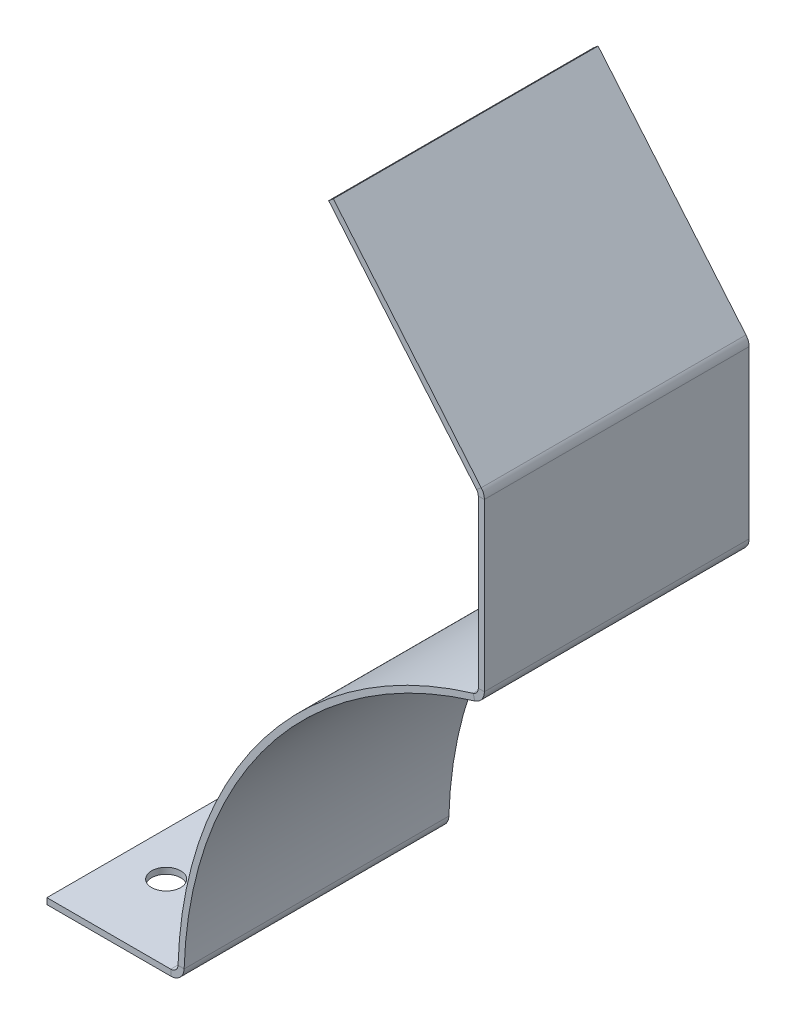
ISO-10303-21;
HEADER;
FILE_DESCRIPTION(('STEP AP214'),'2;1');
FILE_NAME('part.step','',(''),(''),'','','');
FILE_SCHEMA(('AUTOMOTIVE_DESIGN { 1 0 10303 214 1 1 1 1 }'));
ENDSEC;
DATA;
#1=APPLICATION_CONTEXT('core data for automotive mechanical design processes');
#2=APPLICATION_PROTOCOL_DEFINITION('international standard','automotive_design',2000,#1);
#3=PRODUCT_CONTEXT('',#1,'mechanical');
#4=PRODUCT('Part','Part','',(#3));
#5=PRODUCT_RELATED_PRODUCT_CATEGORY('part','',(#4));
#6=PRODUCT_DEFINITION_FORMATION('','',#4);
#7=PRODUCT_DEFINITION_CONTEXT('part definition',#1,'design');
#8=PRODUCT_DEFINITION('design','',#6,#7);
#9=PRODUCT_DEFINITION_SHAPE('','',#8);
#10=(LENGTH_UNIT() NAMED_UNIT(*) SI_UNIT(.MILLI.,.METRE.));
#11=(NAMED_UNIT(*) PLANE_ANGLE_UNIT() SI_UNIT($,.RADIAN.));
#12=(NAMED_UNIT(*) SI_UNIT($,.STERADIAN.) SOLID_ANGLE_UNIT());
#13=UNCERTAINTY_MEASURE_WITH_UNIT(LENGTH_MEASURE(1.E-05),#10,'distance_accuracy_value','');
#14=(GEOMETRIC_REPRESENTATION_CONTEXT(3) GLOBAL_UNCERTAINTY_ASSIGNED_CONTEXT((#13)) GLOBAL_UNIT_ASSIGNED_CONTEXT((#10,
#11,#12)) REPRESENTATION_CONTEXT('',''));
#15=CARTESIAN_POINT('',(0.,0.,0.));
#16=DIRECTION('',(0.,0.,1.));
#17=DIRECTION('',(1.,0.,0.));
#18=AXIS2_PLACEMENT_3D('',#15,#16,#17);
#19=CARTESIAN_POINT('',(-46.6343359967597,173.610704407755,0.));
#20=DIRECTION('',(0.,0.,-1.));
#21=DIRECTION('',(-1.,0.,0.));
#22=AXIS2_PLACEMENT_3D('',#19,#20,#21);
#23=PLANE('',#22);
#24=DIRECTION('',(-2.70456049811991E-05,0.999999999634268,0.));
#25=VECTOR('',#24,1.);
#26=CARTESIAN_POINT('',(-49.286498840737,0.67476912651559,0.));
#27=LINE('',#26,#25);
#28=CARTESIAN_POINT('',(-49.2932056168379,248.655027030668,0.));
#29=VERTEX_POINT('',#28);
#30=CARTESIAN_POINT('',(-49.2912400011612,175.977204615523,0.));
#31=VERTEX_POINT('',#30);
#32=EDGE_CURVE('E288',#29,#31,#27,.F.);
#33=ORIENTED_EDGE('',*,*,#32,.F.);
#34=DIRECTION('',(0.999999999634268,2.7045604985661E-05,0.));
#35=VECTOR('',#34,1.);
#36=CARTESIAN_POINT('',(-49.2932056168379,248.655027030668,0.));
#37=LINE('',#36,#35);
#38=CARTESIAN_POINT('',(-46.6363656178096,248.655098886514,0.));
#39=VERTEX_POINT('',#38);
#40=EDGE_CURVE('E270',#29,#39,#37,.T.);
#41=ORIENTED_EDGE('',*,*,#40,.T.);
#42=DIRECTION('',(2.70456049811991E-05,-0.999999999634268,0.));
#43=VECTOR('',#42,1.);
#44=CARTESIAN_POINT('',(-46.6343359967597,173.610704407755,0.));
#45=LINE('',#44,#43);
#46=CARTESIAN_POINT('',(-46.6344000021329,175.977276471369,0.));
#47=VERTEX_POINT('',#46);
#48=EDGE_CURVE('E156',#39,#47,#45,.T.);
#49=ORIENTED_EDGE('',*,*,#48,.T.);
#50=DIRECTION('',(0.999999999634268,2.70456049811991E-05,0.));
#51=VECTOR('',#50,1.);
#52=CARTESIAN_POINT('',(-49.2912400011612,175.977204615524,0.));
#53=LINE('',#52,#51);
#54=EDGE_CURVE('E297',#31,#47,#53,.T.);
#55=ORIENTED_EDGE('',*,*,#54,.F.);
#56=EDGE_LOOP('',(#33,#41,#49,#55));
#57=FACE_BOUND('',#56,.T.);
#58=ADVANCED_FACE('F80',(#57),#23,.T.);
#59=CARTESIAN_POINT('',(-46.6296588417087,0.674840982360728,0.));
#60=DIRECTION('',(0.999999999634268,2.70456049811991E-05,0.));
#61=DIRECTION('',(-2.70456049811991E-05,0.999999999634268,0.));
#62=AXIS2_PLACEMENT_3D('',#59,#60,#61);
#63=PLANE('',#62);
#64=ORIENTED_EDGE('',*,*,#48,.F.);
#65=DIRECTION('',(0.,0.,-1.));
#66=VECTOR('',#65,1.);
#67=CARTESIAN_POINT('',(-46.6363656178096,248.655098886514,0.));
#68=LINE('',#67,#66);
#69=CARTESIAN_POINT('',(-46.6363656178095,248.655098886514,115.57));
#70=VERTEX_POINT('',#69);
#71=EDGE_CURVE('E265',#39,#70,#68,.F.);
#72=ORIENTED_EDGE('',*,*,#71,.T.);
#73=DIRECTION('',(-2.70456049811991E-05,0.999999999634268,0.));
#74=VECTOR('',#73,1.);
#75=CARTESIAN_POINT('',(-46.6363968718592,249.810704379886,115.57));
#76=LINE('',#75,#74);
#77=CARTESIAN_POINT('',(-46.6344000021329,175.977276471369,115.57));
#78=VERTEX_POINT('',#77);
#79=EDGE_CURVE('E160',#78,#70,#76,.T.);
#80=ORIENTED_EDGE('',*,*,#79,.F.);
#81=DIRECTION('',(0.,0.,-1.));
#82=VECTOR('',#81,1.);
#83=CARTESIAN_POINT('',(-46.6344000021329,175.977276471369,0.));
#84=LINE('',#83,#82);
#85=EDGE_CURVE('E294',#78,#47,#84,.T.);
#86=ORIENTED_EDGE('',*,*,#85,.T.);
#87=EDGE_LOOP('',(#64,#72,#80,#86));
#88=FACE_BOUND('',#87,.T.);
#89=ADVANCED_FACE('F319',(#88),#63,.T.);
#90=CARTESIAN_POINT('',(-49.286498840737,0.67476912651559,0.));
#91=DIRECTION('',(0.999999999634268,2.70456049811991E-05,0.));
#92=DIRECTION('',(-2.70456049811991E-05,0.999999999634268,0.));
#93=AXIS2_PLACEMENT_3D('',#90,#91,#92);
#94=PLANE('',#93);
#95=DIRECTION('',(0.,0.,-1.));
#96=VECTOR('',#95,1.);
#97=CARTESIAN_POINT('',(-49.2932056168379,248.655027030668,0.));
#98=LINE('',#97,#96);
#99=CARTESIAN_POINT('',(-49.2932056168379,248.655027030668,115.57));
#100=VERTEX_POINT('',#99);
#101=EDGE_CURVE('E276',#29,#100,#98,.F.);
#102=ORIENTED_EDGE('',*,*,#101,.F.);
#103=ORIENTED_EDGE('',*,*,#32,.T.);
#104=DIRECTION('',(0.,0.,1.));
#105=VECTOR('',#104,1.);
#106=CARTESIAN_POINT('',(-49.2912400011612,175.977204615524,115.57));
#107=LINE('',#106,#105);
#108=CARTESIAN_POINT('',(-49.2912400011612,175.977204615524,115.57));
#109=VERTEX_POINT('',#108);
#110=EDGE_CURVE('E154',#109,#31,#107,.F.);
#111=ORIENTED_EDGE('',*,*,#110,.F.);
#112=DIRECTION('',(2.70456049811991E-05,-0.999999999634268,0.));
#113=VECTOR('',#112,1.);
#114=CARTESIAN_POINT('',(-49.286498840737,0.674769126515611,115.57));
#115=LINE('',#114,#113);
#116=EDGE_CURVE('E291',#109,#100,#115,.F.);
#117=ORIENTED_EDGE('',*,*,#116,.T.);
#118=EDGE_LOOP('',(#102,#103,#111,#117));
#119=FACE_BOUND('',#118,.T.);
#120=ADVANCED_FACE('F340',(#119),#94,.F.);
#121=CARTESIAN_POINT('',(0.,0.,115.57));
#122=DIRECTION('',(0.,0.,-1.));
#123=DIRECTION('',(-1.,0.,0.));
#124=AXIS2_PLACEMENT_3D('',#121,#122,#123);
#125=CYLINDRICAL_SURFACE('',#124,180.45684);
#126=CARTESIAN_POINT('',(0.,0.,0.));
#127=DIRECTION('',(0.,0.,1.));
#128=DIRECTION('',(1.,0.,0.));
#129=AXIS2_PLACEMENT_3D('',#126,#127,#128);
#130=CIRCLE('',#129,180.45684);
#131=CARTESIAN_POINT('',(-51.5590971428571,172.934469104916,0.));
#132=VERTEX_POINT('',#131);
#133=CARTESIAN_POINT('',(-180.366311024075,5.71532591828572,0.));
#134=VERTEX_POINT('',#133);
#135=EDGE_CURVE('E119',#132,#134,#130,.T.);
#136=ORIENTED_EDGE('',*,*,#135,.T.);
#137=DIRECTION('',(0.,0.,-1.));
#138=VECTOR('',#137,1.);
#139=CARTESIAN_POINT('',(-180.366311024075,5.71532591828572,115.57));
#140=LINE('',#139,#138);
#141=CARTESIAN_POINT('',(-180.366311024075,5.71532591828572,115.57));
#142=VERTEX_POINT('',#141);
#143=EDGE_CURVE('E13',#142,#134,#140,.T.);
#144=ORIENTED_EDGE('',*,*,#143,.F.);
#145=CARTESIAN_POINT('',(0.,0.,115.57));
#146=DIRECTION('',(0.,0.,1.));
#147=DIRECTION('',(1.,0.,0.));
#148=AXIS2_PLACEMENT_3D('',#145,#146,#147);
#149=CIRCLE('',#148,180.45684);
#150=CARTESIAN_POINT('',(-51.5590971428571,172.934469104916,115.57));
#151=VERTEX_POINT('',#150);
#152=EDGE_CURVE('E104',#151,#142,#149,.T.);
#153=ORIENTED_EDGE('',*,*,#152,.F.);
#154=DIRECTION('',(0.,0.,-1.));
#155=VECTOR('',#154,1.);
#156=CARTESIAN_POINT('',(-51.5590971428571,172.934469104916,115.57));
#157=LINE('',#156,#155);
#158=EDGE_CURVE('E116',#151,#132,#157,.T.);
#159=ORIENTED_EDGE('',*,*,#158,.T.);
#160=EDGE_LOOP('',(#136,#144,#153,#159));
#161=FACE_BOUND('',#160,.T.);
#162=ADVANCED_FACE('F82',(#161),#125,.T.);
#163=CARTESIAN_POINT('',(0.,0.,115.57));
#164=DIRECTION('',(0.,0.,-1.));
#165=DIRECTION('',(-1.,0.,0.));
#166=AXIS2_PLACEMENT_3D('',#163,#164,#165);
#167=CYLINDRICAL_SURFACE('',#166,177.8);
#168=CARTESIAN_POINT('',(0.,0.,0.));
#169=DIRECTION('',(0.,0.,1.));
#170=DIRECTION('',(1.,0.,0.));
#171=AXIS2_PLACEMENT_3D('',#168,#169,#170);
#172=CIRCLE('',#171,177.8);
#173=CARTESIAN_POINT('',(-50.7999999999999,170.388379885484,0.));
#174=VERTEX_POINT('',#173);
#175=CARTESIAN_POINT('',(-177.710803869116,5.63118000000001,0.));
#176=VERTEX_POINT('',#175);
#177=EDGE_CURVE('E149',#174,#176,#172,.T.);
#178=ORIENTED_EDGE('',*,*,#177,.F.);
#179=DIRECTION('',(0.,0.,-1.));
#180=VECTOR('',#179,1.);
#181=CARTESIAN_POINT('',(-50.8,170.388379885484,115.57));
#182=LINE('',#181,#180);
#183=CARTESIAN_POINT('',(-50.8,170.388379885484,115.57));
#184=VERTEX_POINT('',#183);
#185=EDGE_CURVE('E125',#184,#174,#182,.T.);
#186=ORIENTED_EDGE('',*,*,#185,.F.);
#187=CARTESIAN_POINT('',(0.,0.,115.57));
#188=DIRECTION('',(0.,0.,1.));
#189=DIRECTION('',(1.,0.,0.));
#190=AXIS2_PLACEMENT_3D('',#187,#188,#189);
#191=CIRCLE('',#190,177.8);
#192=CARTESIAN_POINT('',(-177.710803869116,5.63118000000001,115.57));
#193=VERTEX_POINT('',#192);
#194=EDGE_CURVE('E168',#184,#193,#191,.T.);
#195=ORIENTED_EDGE('',*,*,#194,.T.);
#196=DIRECTION('',(0.,0.,-1.));
#197=VECTOR('',#196,1.);
#198=CARTESIAN_POINT('',(-177.710803869116,5.63118000000001,115.57));
#199=LINE('',#198,#197);
#200=EDGE_CURVE('E88',#193,#176,#199,.T.);
#201=ORIENTED_EDGE('',*,*,#200,.T.);
#202=EDGE_LOOP('',(#178,#186,#195,#201));
#203=FACE_BOUND('',#202,.T.);
#204=ADVANCED_FACE('F179',(#203),#167,.F.);
#205=CARTESIAN_POINT('',(0.,0.,115.57));
#206=DIRECTION('',(0.,0.,1.));
#207=DIRECTION('',(1.,0.,0.));
#208=AXIS2_PLACEMENT_3D('',#205,#206,#207);
#209=PLANE('',#208);
#210=ORIENTED_EDGE('',*,*,#152,.T.);
#211=DIRECTION('',(-0.999498334471971,0.031671428571428,0.));
#212=VECTOR('',#211,1.);
#213=CARTESIAN_POINT('',(-177.710803869116,5.63118000000001,115.57));
#214=LINE('',#213,#212);
#215=EDGE_CURVE('E165',#193,#142,#214,.T.);
#216=ORIENTED_EDGE('',*,*,#215,.F.);
#217=ORIENTED_EDGE('',*,*,#194,.F.);
#218=DIRECTION('',(0.285714285714285,-0.95831484749991,0.));
#219=VECTOR('',#218,1.);
#220=CARTESIAN_POINT('',(-51.5590971428571,172.934469104916,115.57));
#221=LINE('',#220,#219);
#222=EDGE_CURVE('E126',#151,#184,#221,.T.);
#223=ORIENTED_EDGE('',*,*,#222,.F.);
#224=EDGE_LOOP('',(#210,#216,#217,#223));
#225=FACE_BOUND('',#224,.T.);
#226=ADVANCED_FACE('F207',(#225),#209,.T.);
#227=CARTESIAN_POINT('',(0.,0.,0.));
#228=DIRECTION('',(0.,0.,1.));
#229=DIRECTION('',(1.,0.,0.));
#230=AXIS2_PLACEMENT_3D('',#227,#228,#229);
#231=PLANE('',#230);
#232=ORIENTED_EDGE('',*,*,#135,.F.);
#233=DIRECTION('',(0.285714285714285,-0.95831484749991,0.));
#234=VECTOR('',#233,1.);
#235=CARTESIAN_POINT('',(-51.5590971428571,172.934469104916,0.));
#236=LINE('',#235,#234);
#237=EDGE_CURVE('E133',#132,#174,#236,.T.);
#238=ORIENTED_EDGE('',*,*,#237,.T.);
#239=ORIENTED_EDGE('',*,*,#177,.T.);
#240=DIRECTION('',(-0.999498334471971,0.031671428571428,0.));
#241=VECTOR('',#240,1.);
#242=CARTESIAN_POINT('',(-177.710803869116,5.63118000000001,0.));
#243=LINE('',#242,#241);
#244=EDGE_CURVE('E136',#176,#134,#243,.T.);
#245=ORIENTED_EDGE('',*,*,#244,.T.);
#246=EDGE_LOOP('',(#232,#238,#239,#245));
#247=FACE_BOUND('',#246,.T.);
#248=ADVANCED_FACE('F131',(#247),#231,.F.);
#249=CARTESIAN_POINT('',(-52.46624,175.977118745728,115.57));
#250=DIRECTION('',(0.,0.,1.));
#251=DIRECTION('',(0.,-1.,0.));
#252=AXIS2_PLACEMENT_3D('',#249,#250,#251);
#253=PLANE('',#252);
#254=DIRECTION('',(0.999999999634268,2.70456049811991E-05,0.));
#255=VECTOR('',#254,1.);
#256=CARTESIAN_POINT('',(-46.6344000021329,175.977276471369,115.57));
#257=LINE('',#256,#255);
#258=EDGE_CURVE('E283',#109,#78,#257,.T.);
#259=ORIENTED_EDGE('',*,*,#258,.F.);
#260=CARTESIAN_POINT('',(-52.46624,175.977118745728,115.57));
#261=DIRECTION('',(0.,0.,-1.));
#262=DIRECTION('',(0.,1.,0.));
#263=AXIS2_PLACEMENT_3D('',#260,#261,#262);
#264=CIRCLE('',#263,3.17499999999999);
#265=EDGE_CURVE('E155',#151,#109,#264,.F.);
#266=ORIENTED_EDGE('',*,*,#265,.F.);
#267=ORIENTED_EDGE('',*,*,#222,.T.);
#268=CARTESIAN_POINT('',(-52.46624,175.977118745728,115.57));
#269=DIRECTION('',(0.,0.,-1.));
#270=DIRECTION('',(0.,1.,0.));
#271=AXIS2_PLACEMENT_3D('',#268,#269,#270);
#272=CIRCLE('',#271,5.83183999999999);
#273=EDGE_CURVE('E137',#184,#78,#272,.F.);
#274=ORIENTED_EDGE('',*,*,#273,.T.);
#275=EDGE_LOOP('',(#259,#266,#267,#274));
#276=FACE_BOUND('',#275,.T.);
#277=ADVANCED_FACE('F307',(#276),#253,.T.);
#278=CARTESIAN_POINT('',(-52.46624,175.977118745728,0.));
#279=DIRECTION('',(0.,0.,1.));
#280=DIRECTION('',(0.,-1.,0.));
#281=AXIS2_PLACEMENT_3D('',#278,#279,#280);
#282=PLANE('',#281);
#283=CARTESIAN_POINT('',(-52.46624,175.977118745728,0.));
#284=DIRECTION('',(0.,0.,-1.));
#285=DIRECTION('',(0.,1.,0.));
#286=AXIS2_PLACEMENT_3D('',#283,#284,#285);
#287=CIRCLE('',#286,3.17499999999999);
#288=EDGE_CURVE('E145',#31,#132,#287,.T.);
#289=ORIENTED_EDGE('',*,*,#288,.F.);
#290=ORIENTED_EDGE('',*,*,#54,.T.);
#291=CARTESIAN_POINT('',(-52.46624,175.977118745728,0.));
#292=DIRECTION('',(0.,0.,-1.));
#293=DIRECTION('',(0.,1.,0.));
#294=AXIS2_PLACEMENT_3D('',#291,#292,#293);
#295=CIRCLE('',#294,5.83183999999999);
#296=EDGE_CURVE('E148',#47,#174,#295,.T.);
#297=ORIENTED_EDGE('',*,*,#296,.T.);
#298=ORIENTED_EDGE('',*,*,#237,.F.);
#299=EDGE_LOOP('',(#289,#290,#297,#298));
#300=FACE_BOUND('',#299,.T.);
#301=ADVANCED_FACE('F142',(#300),#282,.F.);
#302=CARTESIAN_POINT('',(-52.46624,175.977118745728,0.));
#303=DIRECTION('',(0.,0.,-1.));
#304=DIRECTION('',(0.999999999634268,2.70456049811991E-05,0.));
#305=AXIS2_PLACEMENT_3D('',#302,#303,#304);
#306=CYLINDRICAL_SURFACE('',#305,5.83183999999999);
#307=ORIENTED_EDGE('',*,*,#185,.T.);
#308=ORIENTED_EDGE('',*,*,#296,.F.);
#309=ORIENTED_EDGE('',*,*,#85,.F.);
#310=ORIENTED_EDGE('',*,*,#273,.F.);
#311=EDGE_LOOP('',(#307,#308,#309,#310));
#312=FACE_BOUND('',#311,.T.);
#313=ADVANCED_FACE('F444',(#312),#306,.T.);
#314=CARTESIAN_POINT('',(-52.46624,175.977118745728,0.));
#315=DIRECTION('',(0.,0.,-1.));
#316=DIRECTION('',(0.999999999634268,2.70456049811991E-05,0.));
#317=AXIS2_PLACEMENT_3D('',#314,#315,#316);
#318=CYLINDRICAL_SURFACE('',#317,3.17499999999999);
#319=ORIENTED_EDGE('',*,*,#158,.F.);
#320=ORIENTED_EDGE('',*,*,#265,.T.);
#321=ORIENTED_EDGE('',*,*,#110,.T.);
#322=ORIENTED_EDGE('',*,*,#288,.T.);
#323=EDGE_LOOP('',(#319,#320,#321,#322));
#324=FACE_BOUND('',#323,.T.);
#325=ADVANCED_FACE('F152',(#324),#318,.F.);
#326=CARTESIAN_POINT('',(-46.6363968718592,249.810704379886,115.57));
#327=DIRECTION('',(0.,0.,1.));
#328=DIRECTION('',(0.,-1.,0.));
#329=AXIS2_PLACEMENT_3D('',#326,#327,#328);
#330=PLANE('',#329);
#331=DIRECTION('',(0.999999999634268,2.7045604985661E-05,0.));
#332=VECTOR('',#331,1.);
#333=CARTESIAN_POINT('',(-49.2932056168379,248.655027030668,115.57));
#334=LINE('',#333,#332);
#335=EDGE_CURVE('E281',#100,#70,#334,.T.);
#336=ORIENTED_EDGE('',*,*,#335,.F.);
#337=ORIENTED_EDGE('',*,*,#116,.F.);
#338=ORIENTED_EDGE('',*,*,#258,.T.);
#339=ORIENTED_EDGE('',*,*,#79,.T.);
#340=EDGE_LOOP('',(#336,#337,#338,#339));
#341=FACE_BOUND('',#340,.T.);
#342=ADVANCED_FACE('F316',(#341),#330,.T.);
#343=CARTESIAN_POINT('',(-52.4682056156767,248.654941160873,115.57));
#344=DIRECTION('',(0.,0.,1.));
#345=DIRECTION('',(1.,0.,0.));
#346=AXIS2_PLACEMENT_3D('',#343,#344,#345);
#347=PLANE('',#346);
#348=DIRECTION('',(0.766027058259036,0.642808327586853,0.));
#349=VECTOR('',#348,1.);
#350=CARTESIAN_POINT('',(-50.0360697057042,250.695857600961,115.57));
#351=LINE('',#350,#349);
#352=CARTESIAN_POINT('',(-50.0360697057043,250.695857600961,115.57));
#353=VERTEX_POINT('',#352);
#354=CARTESIAN_POINT('',(-48.0008583762393,252.403696478027,115.57));
#355=VERTEX_POINT('',#354);
#356=EDGE_CURVE('E233',#353,#355,#351,.T.);
#357=ORIENTED_EDGE('',*,*,#356,.F.);
#358=CARTESIAN_POINT('',(-52.4682056156767,248.654941160873,115.57));
#359=DIRECTION('',(0.,0.,-1.));
#360=DIRECTION('',(-1.,0.,0.));
#361=AXIS2_PLACEMENT_3D('',#358,#359,#360);
#362=CIRCLE('',#361,3.17500000000001);
#363=EDGE_CURVE('E273',#100,#353,#362,.F.);
#364=ORIENTED_EDGE('',*,*,#363,.F.);
#365=ORIENTED_EDGE('',*,*,#335,.T.);
#366=CARTESIAN_POINT('',(-52.4682056156767,248.654941160873,115.57));
#367=DIRECTION('',(0.,0.,-1.));
#368=DIRECTION('',(-1.,0.,0.));
#369=AXIS2_PLACEMENT_3D('',#366,#367,#368);
#370=CIRCLE('',#369,5.83184000000001);
#371=EDGE_CURVE('E95',#70,#355,#370,.F.);
#372=ORIENTED_EDGE('',*,*,#371,.T.);
#373=EDGE_LOOP('',(#357,#364,#365,#372));
#374=FACE_BOUND('',#373,.T.);
#375=ADVANCED_FACE('F443',(#374),#347,.T.);
#376=CARTESIAN_POINT('',(-52.4682056156767,248.654941160873,0.));
#377=DIRECTION('',(0.,0.,1.));
#378=DIRECTION('',(1.,0.,0.));
#379=AXIS2_PLACEMENT_3D('',#376,#377,#378);
#380=PLANE('',#379);
#381=CARTESIAN_POINT('',(-52.4682056156767,248.654941160873,0.));
#382=DIRECTION('',(0.,0.,-1.));
#383=DIRECTION('',(-1.,0.,0.));
#384=AXIS2_PLACEMENT_3D('',#381,#382,#383);
#385=CIRCLE('',#384,3.17500000000001);
#386=CARTESIAN_POINT('',(-50.0360697057043,250.695857600961,0.));
#387=VERTEX_POINT('',#386);
#388=EDGE_CURVE('E264',#387,#29,#385,.T.);
#389=ORIENTED_EDGE('',*,*,#388,.F.);
#390=DIRECTION('',(0.766027058259036,0.642808327586853,0.));
#391=VECTOR('',#390,1.);
#392=CARTESIAN_POINT('',(-50.0360697057042,250.695857600961,0.));
#393=LINE('',#392,#391);
#394=CARTESIAN_POINT('',(-48.0008583762393,252.403696478027,0.));
#395=VERTEX_POINT('',#394);
#396=EDGE_CURVE('E232',#387,#395,#393,.T.);
#397=ORIENTED_EDGE('',*,*,#396,.T.);
#398=CARTESIAN_POINT('',(-52.4682056156767,248.654941160873,0.));
#399=DIRECTION('',(0.,0.,-1.));
#400=DIRECTION('',(-1.,0.,0.));
#401=AXIS2_PLACEMENT_3D('',#398,#399,#400);
#402=CIRCLE('',#401,5.83184000000001);
#403=EDGE_CURVE('E268',#395,#39,#402,.T.);
#404=ORIENTED_EDGE('',*,*,#403,.T.);
#405=ORIENTED_EDGE('',*,*,#40,.F.);
#406=EDGE_LOOP('',(#389,#397,#404,#405));
#407=FACE_BOUND('',#406,.T.);
#408=ADVANCED_FACE('F329',(#407),#380,.F.);
#409=CARTESIAN_POINT('',(-52.4682056156767,248.654941160873,0.));
#410=DIRECTION('',(0.,0.,-1.));
#411=DIRECTION('',(0.766027058259036,0.642808327586853,0.));
#412=AXIS2_PLACEMENT_3D('',#409,#410,#411);
#413=CYLINDRICAL_SURFACE('',#412,5.83184000000001);
#414=ORIENTED_EDGE('',*,*,#71,.F.);
#415=ORIENTED_EDGE('',*,*,#403,.F.);
#416=DIRECTION('',(0.,0.,1.));
#417=VECTOR('',#416,1.);
#418=CARTESIAN_POINT('',(-48.0008583762393,252.403696478027,0.));
#419=LINE('',#418,#417);
#420=EDGE_CURVE('E236',#395,#355,#419,.T.);
#421=ORIENTED_EDGE('',*,*,#420,.T.);
#422=ORIENTED_EDGE('',*,*,#371,.F.);
#423=EDGE_LOOP('',(#414,#415,#421,#422));
#424=FACE_BOUND('',#423,.T.);
#425=ADVANCED_FACE('F323',(#424),#413,.T.);
#426=CARTESIAN_POINT('',(-52.4682056156767,248.654941160873,0.));
#427=DIRECTION('',(0.,0.,-1.));
#428=DIRECTION('',(0.766027058259036,0.642808327586853,0.));
#429=AXIS2_PLACEMENT_3D('',#426,#427,#428);
#430=CYLINDRICAL_SURFACE('',#429,3.17500000000001);
#431=ORIENTED_EDGE('',*,*,#101,.T.);
#432=ORIENTED_EDGE('',*,*,#363,.T.);
#433=DIRECTION('',(0.,0.,-1.));
#434=VECTOR('',#433,1.);
#435=CARTESIAN_POINT('',(-50.0360697057042,250.695857600961,115.57));
#436=LINE('',#435,#434);
#437=EDGE_CURVE('E229',#353,#387,#436,.T.);
#438=ORIENTED_EDGE('',*,*,#437,.T.);
#439=ORIENTED_EDGE('',*,*,#388,.T.);
#440=EDGE_LOOP('',(#431,#432,#438,#439));
#441=FACE_BOUND('',#440,.T.);
#442=ADVANCED_FACE('F582',(#441),#430,.F.);
#443=CARTESIAN_POINT('',(-47.2580255414226,251.518471401107,115.57));
#444=DIRECTION('',(0.,0.,-1.));
#445=DIRECTION('',(-1.,0.,0.));
#446=AXIS2_PLACEMENT_3D('',#443,#444,#445);
#447=PLANE('',#446);
#448=ORIENTED_EDGE('',*,*,#356,.T.);
#449=DIRECTION('',(0.642808327586853,-0.766027058259036,0.));
#450=VECTOR('',#449,1.);
#451=CARTESIAN_POINT('',(-47.2580255414226,251.518471401107,115.57));
#452=LINE('',#451,#450);
#453=CARTESIAN_POINT('',(-112.567351624247,329.346820520225,115.57));
#454=VERTEX_POINT('',#453);
#455=EDGE_CURVE('E241',#454,#355,#452,.T.);
#456=ORIENTED_EDGE('',*,*,#455,.F.);
#457=DIRECTION('',(-0.766027058259036,-0.642808327586853,0.));
#458=VECTOR('',#457,1.);
#459=CARTESIAN_POINT('',(-112.567351624247,329.346820520225,115.57));
#460=LINE('',#459,#458);
#461=CARTESIAN_POINT('',(-114.602562953712,327.638981643159,115.57));
#462=VERTEX_POINT('',#461);
#463=EDGE_CURVE('E251',#454,#462,#460,.T.);
#464=ORIENTED_EDGE('',*,*,#463,.T.);
#465=DIRECTION('',(0.642808327586853,-0.766027058259036,0.));
#466=VECTOR('',#465,1.);
#467=CARTESIAN_POINT('',(-49.2932368708876,249.810632524041,115.57));
#468=LINE('',#467,#466);
#469=EDGE_CURVE('E240',#462,#353,#468,.T.);
#470=ORIENTED_EDGE('',*,*,#469,.T.);
#471=EDGE_LOOP('',(#448,#456,#464,#470));
#472=FACE_BOUND('',#471,.T.);
#473=ADVANCED_FACE('F571',(#472),#447,.F.);
#474=CARTESIAN_POINT('',(-112.567351624247,329.346820520225,0.));
#475=DIRECTION('',(0.,0.,1.));
#476=DIRECTION('',(0.,-1.,0.));
#477=AXIS2_PLACEMENT_3D('',#474,#475,#476);
#478=PLANE('',#477);
#479=ORIENTED_EDGE('',*,*,#396,.F.);
#480=DIRECTION('',(-0.642808327586853,0.766027058259036,0.));
#481=VECTOR('',#480,1.);
#482=CARTESIAN_POINT('',(-114.602562953712,327.638981643159,0.));
#483=LINE('',#482,#481);
#484=CARTESIAN_POINT('',(-114.602562953712,327.638981643159,0.));
#485=VERTEX_POINT('',#484);
#486=EDGE_CURVE('E254',#387,#485,#483,.T.);
#487=ORIENTED_EDGE('',*,*,#486,.T.);
#488=DIRECTION('',(-0.766027058259036,-0.642808327586853,0.));
#489=VECTOR('',#488,1.);
#490=CARTESIAN_POINT('',(-112.567351624247,329.346820520225,0.));
#491=LINE('',#490,#489);
#492=CARTESIAN_POINT('',(-112.567351624247,329.346820520225,0.));
#493=VERTEX_POINT('',#492);
#494=EDGE_CURVE('E261',#493,#485,#491,.T.);
#495=ORIENTED_EDGE('',*,*,#494,.F.);
#496=DIRECTION('',(-0.642808327586853,0.766027058259036,0.));
#497=VECTOR('',#496,1.);
#498=CARTESIAN_POINT('',(-112.567351624247,329.346820520225,0.));
#499=LINE('',#498,#497);
#500=EDGE_CURVE('E244',#395,#493,#499,.T.);
#501=ORIENTED_EDGE('',*,*,#500,.F.);
#502=EDGE_LOOP('',(#479,#487,#495,#501));
#503=FACE_BOUND('',#502,.T.);
#504=ADVANCED_FACE('F560',(#503),#478,.F.);
#505=CARTESIAN_POINT('',(96.1189623179318,80.6578158706245,0.));
#506=DIRECTION('',(-0.766027058259036,-0.642808327586853,0.));
#507=DIRECTION('',(0.642808327586853,-0.766027058259036,0.));
#508=AXIS2_PLACEMENT_3D('',#505,#506,#507);
#509=PLANE('',#508);
#510=ORIENTED_EDGE('',*,*,#420,.F.);
#511=ORIENTED_EDGE('',*,*,#500,.T.);
#512=DIRECTION('',(0.,0.,1.));
#513=VECTOR('',#512,1.);
#514=CARTESIAN_POINT('',(-112.567351624247,329.346820520225,115.57));
#515=LINE('',#514,#513);
#516=EDGE_CURVE('E248',#493,#454,#515,.T.);
#517=ORIENTED_EDGE('',*,*,#516,.T.);
#518=ORIENTED_EDGE('',*,*,#455,.T.);
#519=EDGE_LOOP('',(#510,#511,#517,#518));
#520=FACE_BOUND('',#519,.T.);
#521=ADVANCED_FACE('F549',(#520),#509,.F.);
#522=CARTESIAN_POINT('',(94.0837509884668,78.9499769935587,0.));
#523=DIRECTION('',(-0.766027058259036,-0.642808327586853,0.));
#524=DIRECTION('',(0.642808327586853,-0.766027058259036,0.));
#525=AXIS2_PLACEMENT_3D('',#522,#523,#524);
#526=PLANE('',#525);
#527=ORIENTED_EDGE('',*,*,#486,.F.);
#528=ORIENTED_EDGE('',*,*,#437,.F.);
#529=ORIENTED_EDGE('',*,*,#469,.F.);
#530=DIRECTION('',(0.,0.,1.));
#531=VECTOR('',#530,1.);
#532=CARTESIAN_POINT('',(-114.602562953712,327.638981643159,115.57));
#533=LINE('',#532,#531);
#534=EDGE_CURVE('E245',#485,#462,#533,.T.);
#535=ORIENTED_EDGE('',*,*,#534,.F.);
#536=EDGE_LOOP('',(#527,#528,#529,#535));
#537=FACE_BOUND('',#536,.T.);
#538=ADVANCED_FACE('F536',(#537),#526,.T.);
#539=CARTESIAN_POINT('',(-112.567351624247,329.346820520225,115.57));
#540=DIRECTION('',(0.642808327586853,-0.766027058259036,0.));
#541=DIRECTION('',(0.766027058259036,0.642808327586853,0.));
#542=AXIS2_PLACEMENT_3D('',#539,#540,#541);
#543=PLANE('',#542);
#544=ORIENTED_EDGE('',*,*,#534,.T.);
#545=ORIENTED_EDGE('',*,*,#463,.F.);
#546=ORIENTED_EDGE('',*,*,#516,.F.);
#547=ORIENTED_EDGE('',*,*,#494,.T.);
#548=EDGE_LOOP('',(#544,#545,#546,#547));
#549=FACE_BOUND('',#548,.T.);
#550=ADVANCED_FACE('F531',(#549),#543,.F.);
#551=CARTESIAN_POINT('',(-183.539718236024,5.815882704,0.));
#552=DIRECTION('',(0.,0.,-1.));
#553=DIRECTION('',(-1.,0.,0.));
#554=AXIS2_PLACEMENT_3D('',#551,#552,#553);
#555=PLANE('',#554);
#556=DIRECTION('',(-8.62663278542215E-05,-0.99999999627906,0.));
#557=VECTOR('',#556,1.);
#558=CARTESIAN_POINT('',(-183.540221327445,-0.0159572743000692,0.));
#559=LINE('',#558,#557);
#560=CARTESIAN_POINT('',(-183.539992131614,2.64088271581396,0.));
#561=VERTEX_POINT('',#560);
#562=CARTESIAN_POINT('',(-183.540221327445,-0.0159572743000944,0.));
#563=VERTEX_POINT('',#562);
#564=EDGE_CURVE('E223',#561,#563,#559,.T.);
#565=ORIENTED_EDGE('',*,*,#564,.F.);
#566=CARTESIAN_POINT('',(-183.539718236024,5.815882704,0.));
#567=DIRECTION('',(0.,0.,1.));
#568=DIRECTION('',(1.,0.,0.));
#569=AXIS2_PLACEMENT_3D('',#566,#567,#568);
#570=CIRCLE('',#569,3.17500000000002);
#571=EDGE_CURVE('E204',#134,#561,#570,.F.);
#572=ORIENTED_EDGE('',*,*,#571,.F.);
#573=ORIENTED_EDGE('',*,*,#244,.F.);
#574=CARTESIAN_POINT('',(-183.539718236024,5.815882704,0.));
#575=DIRECTION('',(0.,0.,1.));
#576=DIRECTION('',(1.,0.,0.));
#577=AXIS2_PLACEMENT_3D('',#574,#575,#576);
#578=CIRCLE('',#577,5.83184000000002);
#579=EDGE_CURVE('E191',#176,#563,#578,.F.);
#580=ORIENTED_EDGE('',*,*,#579,.T.);
#581=EDGE_LOOP('',(#565,#572,#573,#580));
#582=FACE_BOUND('',#581,.T.);
#583=ADVANCED_FACE('F221',(#582),#555,.T.);
#584=CARTESIAN_POINT('',(-183.539718236024,5.815882704,115.57));
#585=DIRECTION('',(0.,0.,-1.));
#586=DIRECTION('',(-1.,0.,0.));
#587=AXIS2_PLACEMENT_3D('',#584,#585,#586);
#588=PLANE('',#587);
#589=CARTESIAN_POINT('',(-183.539718236024,5.815882704,115.57));
#590=DIRECTION('',(0.,0.,1.));
#591=DIRECTION('',(1.,0.,0.));
#592=AXIS2_PLACEMENT_3D('',#589,#590,#591);
#593=CIRCLE('',#592,3.17500000000002);
#594=CARTESIAN_POINT('',(-183.539992131614,2.64088271581396,115.57));
#595=VERTEX_POINT('',#594);
#596=EDGE_CURVE('E217',#595,#142,#593,.T.);
#597=ORIENTED_EDGE('',*,*,#596,.F.);
#598=DIRECTION('',(-8.62663278542215E-05,-0.99999999627906,0.));
#599=VECTOR('',#598,1.);
#600=CARTESIAN_POINT('',(-183.539992131614,2.64088271581396,115.57));
#601=LINE('',#600,#599);
#602=CARTESIAN_POINT('',(-183.540221327445,-0.0159572743000683,115.57));
#603=VERTEX_POINT('',#602);
#604=EDGE_CURVE('E202',#595,#603,#601,.T.);
#605=ORIENTED_EDGE('',*,*,#604,.T.);
#606=CARTESIAN_POINT('',(-183.539718236024,5.815882704,115.57));
#607=DIRECTION('',(0.,0.,1.));
#608=DIRECTION('',(1.,0.,0.));
#609=AXIS2_PLACEMENT_3D('',#606,#607,#608);
#610=CIRCLE('',#609,5.83184000000002);
#611=EDGE_CURVE('E188',#603,#193,#610,.T.);
#612=ORIENTED_EDGE('',*,*,#611,.T.);
#613=ORIENTED_EDGE('',*,*,#215,.T.);
#614=EDGE_LOOP('',(#597,#605,#612,#613));
#615=FACE_BOUND('',#614,.T.);
#616=ADVANCED_FACE('F198',(#615),#588,.F.);
#617=CARTESIAN_POINT('',(-183.539718236024,5.815882704,115.57));
#618=DIRECTION('',(0.,0.,1.));
#619=DIRECTION('',(-8.62663278542216E-05,-0.99999999627906,0.));
#620=AXIS2_PLACEMENT_3D('',#617,#618,#619);
#621=CYLINDRICAL_SURFACE('',#620,5.83184000000002);
#622=ORIENTED_EDGE('',*,*,#200,.F.);
#623=ORIENTED_EDGE('',*,*,#611,.F.);
#624=DIRECTION('',(0.,0.,1.));
#625=VECTOR('',#624,1.);
#626=CARTESIAN_POINT('',(-183.540221327445,-0.0159572743000678,0.));
#627=LINE('',#626,#625);
#628=EDGE_CURVE('E399',#563,#603,#627,.T.);
#629=ORIENTED_EDGE('',*,*,#628,.F.);
#630=ORIENTED_EDGE('',*,*,#579,.F.);
#631=EDGE_LOOP('',(#622,#623,#629,#630));
#632=FACE_BOUND('',#631,.T.);
#633=ADVANCED_FACE('F185',(#632),#621,.T.);
#634=CARTESIAN_POINT('',(-183.539718236024,5.815882704,115.57));
#635=DIRECTION('',(0.,0.,1.));
#636=DIRECTION('',(-8.62663278542216E-05,-0.99999999627906,0.));
#637=AXIS2_PLACEMENT_3D('',#634,#635,#636);
#638=CYLINDRICAL_SURFACE('',#637,3.17500000000002);
#639=ORIENTED_EDGE('',*,*,#143,.T.);
#640=ORIENTED_EDGE('',*,*,#571,.T.);
#641=DIRECTION('',(0.,0.,-1.));
#642=VECTOR('',#641,1.);
#643=CARTESIAN_POINT('',(-183.539992131614,2.64088271581396,0.));
#644=LINE('',#643,#642);
#645=EDGE_CURVE('E411',#561,#595,#644,.F.);
#646=ORIENTED_EDGE('',*,*,#645,.T.);
#647=ORIENTED_EDGE('',*,*,#596,.T.);
#648=EDGE_LOOP('',(#639,#640,#646,#647));
#649=FACE_BOUND('',#648,.T.);
#650=ADVANCED_FACE('F213',(#649),#638,.F.);
#651=CARTESIAN_POINT('',(-180.463969509973,-0.0162226512489048,115.57));
#652=DIRECTION('',(0.,0.,1.));
#653=DIRECTION('',(1.,0.,0.));
#654=AXIS2_PLACEMENT_3D('',#651,#652,#653);
#655=PLANE('',#654);
#656=DIRECTION('',(0.99999999627906,-8.62663278542216E-05,0.));
#657=VECTOR('',#656,1.);
#658=CARTESIAN_POINT('',(-180.463969509973,-0.0162226512489048,115.57));
#659=LINE('',#658,#657);
#660=CARTESIAN_POINT('',(-237.613969297321,-0.0112925306120361,115.57));
#661=VERTEX_POINT('',#660);
#662=EDGE_CURVE('E381',#661,#603,#659,.T.);
#663=ORIENTED_EDGE('',*,*,#662,.T.);
#664=ORIENTED_EDGE('',*,*,#604,.F.);
#665=DIRECTION('',(-0.99999999627906,8.62663278542216E-05,0.));
#666=VECTOR('',#665,1.);
#667=CARTESIAN_POINT('',(-0.0969375921540186,2.62505775706963,115.57));
#668=LINE('',#667,#666);
#669=CARTESIAN_POINT('',(-237.613740101491,2.64554745950202,115.57));
#670=VERTEX_POINT('',#669);
#671=EDGE_CURVE('E383',#670,#595,#668,.F.);
#672=ORIENTED_EDGE('',*,*,#671,.F.);
#673=DIRECTION('',(8.62663278542244E-05,0.99999999627906,0.));
#674=VECTOR('',#673,1.);
#675=CARTESIAN_POINT('',(-237.613969297321,-0.0112925306120361,115.57));
#676=LINE('',#675,#674);
#677=EDGE_CURVE('E225',#661,#670,#676,.T.);
#678=ORIENTED_EDGE('',*,*,#677,.F.);
#679=EDGE_LOOP('',(#663,#664,#672,#678));
#680=FACE_BOUND('',#679,.T.);
#681=ADVANCED_FACE('F379',(#680),#655,.T.);
#682=CARTESIAN_POINT('',(-237.613969297321,-0.0112925306120361,0.));
#683=DIRECTION('',(0.,0.,-1.));
#684=DIRECTION('',(-1.,0.,0.));
#685=AXIS2_PLACEMENT_3D('',#682,#683,#684);
#686=PLANE('',#685);
#687=DIRECTION('',(0.99999999627906,-8.62663278542216E-05,0.));
#688=VECTOR('',#687,1.);
#689=CARTESIAN_POINT('',(-0.0969375921540186,2.62505775706963,0.));
#690=LINE('',#689,#688);
#691=CARTESIAN_POINT('',(-237.613740101491,2.64554745950202,0.));
#692=VERTEX_POINT('',#691);
#693=EDGE_CURVE('E407',#561,#692,#690,.F.);
#694=ORIENTED_EDGE('',*,*,#693,.F.);
#695=ORIENTED_EDGE('',*,*,#564,.T.);
#696=DIRECTION('',(-0.99999999627906,8.62663278542216E-05,0.));
#697=VECTOR('',#696,1.);
#698=CARTESIAN_POINT('',(-237.613969297321,-0.0112925306120361,0.));
#699=LINE('',#698,#697);
#700=CARTESIAN_POINT('',(-237.613969297321,-0.0112925306120361,0.));
#701=VERTEX_POINT('',#700);
#702=EDGE_CURVE('E396',#563,#701,#699,.T.);
#703=ORIENTED_EDGE('',*,*,#702,.T.);
#704=DIRECTION('',(8.62663278542244E-05,0.99999999627906,0.));
#705=VECTOR('',#704,1.);
#706=CARTESIAN_POINT('',(-237.613969297321,-0.0112925306120361,0.));
#707=LINE('',#706,#705);
#708=EDGE_CURVE('E387',#701,#692,#707,.T.);
#709=ORIENTED_EDGE('',*,*,#708,.T.);
#710=EDGE_LOOP('',(#694,#695,#703,#709));
#711=FACE_BOUND('',#710,.T.);
#712=ADVANCED_FACE('F416',(#711),#686,.T.);
#713=CARTESIAN_POINT('',(-0.0971667879845148,-0.0317822330444324,0.));
#714=DIRECTION('',(-8.62663278542216E-05,-0.99999999627906,0.));
#715=DIRECTION('',(0.99999999627906,-8.62663278542216E-05,0.));
#716=AXIS2_PLACEMENT_3D('',#713,#714,#715);
#717=PLANE('',#716);
#718=CARTESIAN_POINT('',(-218.563969368205,-0.0129359041576576,31.75));
#719=DIRECTION('',(-8.62663278542216E-05,-0.99999999627906,0.));
#720=DIRECTION('',(0.99999999627906,-8.62663278542216E-05,0.));
#721=AXIS2_PLACEMENT_3D('',#718,#719,#720);
#722=CIRCLE('',#721,6.35);
#723=CARTESIAN_POINT('',(-212.213969391833,-0.0134836953395319,31.75));
#724=VERTEX_POINT('',#723);
#725=EDGE_CURVE('E763',#724,#724,#722,.F.);
#726=ORIENTED_EDGE('',*,*,#725,.T.);
#727=EDGE_LOOP('',(#726));
#728=FACE_BOUND('',#727,.T.);
#729=CARTESIAN_POINT('',(-218.563969368205,-0.0129359041576576,82.55));
#730=DIRECTION('',(-8.62663278542216E-05,-0.99999999627906,0.));
#731=DIRECTION('',(0.99999999627906,-8.62663278542216E-05,0.));
#732=AXIS2_PLACEMENT_3D('',#729,#730,#731);
#733=CIRCLE('',#732,6.35);
#734=CARTESIAN_POINT('',(-212.213969391833,-0.0134836953395319,82.55));
#735=VERTEX_POINT('',#734);
#736=EDGE_CURVE('E771',#735,#735,#733,.F.);
#737=ORIENTED_EDGE('',*,*,#736,.T.);
#738=EDGE_LOOP('',(#737));
#739=FACE_BOUND('',#738,.T.);
#740=ORIENTED_EDGE('',*,*,#702,.F.);
#741=ORIENTED_EDGE('',*,*,#628,.T.);
#742=ORIENTED_EDGE('',*,*,#662,.F.);
#743=DIRECTION('',(0.,0.,1.));
#744=VECTOR('',#743,1.);
#745=CARTESIAN_POINT('',(-237.613969297321,-0.0112925306120361,115.57));
#746=LINE('',#745,#744);
#747=EDGE_CURVE('E391',#701,#661,#746,.T.);
#748=ORIENTED_EDGE('',*,*,#747,.F.);
#749=EDGE_LOOP('',(#740,#741,#742,#748));
#750=FACE_BOUND('',#749,.T.);
#751=ADVANCED_FACE('F398',(#728,#739,#750),#717,.T.);
#752=CARTESIAN_POINT('',(-0.0969375921540186,2.62505775706963,0.));
#753=DIRECTION('',(-8.62663278542216E-05,-0.99999999627906,0.));
#754=DIRECTION('',(0.99999999627906,-8.62663278542216E-05,0.));
#755=AXIS2_PLACEMENT_3D('',#752,#753,#754);
#756=PLANE('',#755);
#757=CARTESIAN_POINT('',(-218.563740172375,2.6439040859564,31.75));
#758=DIRECTION('',(8.62663278542036E-05,0.99999999627906,0.));
#759=DIRECTION('',(-0.99999999627906,8.62663278542036E-05,0.));
#760=AXIS2_PLACEMENT_3D('',#757,#758,#759);
#761=CIRCLE('',#760,6.35);
#762=CARTESIAN_POINT('',(-224.913740148747,2.64445187713827,31.75));
#763=VERTEX_POINT('',#762);
#764=EDGE_CURVE('E413',#763,#763,#761,.T.);
#765=ORIENTED_EDGE('',*,*,#764,.F.);
#766=EDGE_LOOP('',(#765));
#767=FACE_BOUND('',#766,.T.);
#768=CARTESIAN_POINT('',(-218.563740172375,2.6439040859564,82.55));
#769=DIRECTION('',(8.62663278542036E-05,0.99999999627906,0.));
#770=DIRECTION('',(-0.99999999627906,8.62663278542036E-05,0.));
#771=AXIS2_PLACEMENT_3D('',#768,#769,#770);
#772=CIRCLE('',#771,6.35);
#773=CARTESIAN_POINT('',(-224.913740148747,2.64445187713827,82.55));
#774=VERTEX_POINT('',#773);
#775=EDGE_CURVE('E766',#774,#774,#772,.T.);
#776=ORIENTED_EDGE('',*,*,#775,.F.);
#777=EDGE_LOOP('',(#776));
#778=FACE_BOUND('',#777,.T.);
#779=ORIENTED_EDGE('',*,*,#645,.F.);
#780=ORIENTED_EDGE('',*,*,#693,.T.);
#781=DIRECTION('',(0.,0.,-1.));
#782=VECTOR('',#781,1.);
#783=CARTESIAN_POINT('',(-237.613740101491,2.64554745950202,0.));
#784=LINE('',#783,#782);
#785=EDGE_CURVE('E405',#692,#670,#784,.F.);
#786=ORIENTED_EDGE('',*,*,#785,.T.);
#787=ORIENTED_EDGE('',*,*,#671,.T.);
#788=EDGE_LOOP('',(#779,#780,#786,#787));
#789=FACE_BOUND('',#788,.T.);
#790=ADVANCED_FACE('F418',(#767,#778,#789),#756,.F.);
#791=CARTESIAN_POINT('',(-237.613969297321,-0.0112925306120361,115.57));
#792=DIRECTION('',(-0.99999999627906,8.62663278542244E-05,0.));
#793=DIRECTION('',(-8.62663278542244E-05,-0.99999999627906,0.));
#794=AXIS2_PLACEMENT_3D('',#791,#792,#793);
#795=PLANE('',#794);
#796=ORIENTED_EDGE('',*,*,#785,.F.);
#797=ORIENTED_EDGE('',*,*,#708,.F.);
#798=ORIENTED_EDGE('',*,*,#747,.T.);
#799=ORIENTED_EDGE('',*,*,#677,.T.);
#800=EDGE_LOOP('',(#796,#797,#798,#799));
#801=FACE_BOUND('',#800,.T.);
#802=ADVANCED_FACE('F392',(#801),#795,.T.);
#803=CARTESIAN_POINT('',(-218.563969856891,-0.0186007557698132,82.55));
#804=DIRECTION('',(8.62663278542215E-05,0.99999999627906,0.));
#805=DIRECTION('',(-0.99999999627906,8.62663278542215E-05,0.));
#806=AXIS2_PLACEMENT_3D('',#803,#804,#805);
#807=CYLINDRICAL_SURFACE('',#806,6.35);
#808=ORIENTED_EDGE('',*,*,#736,.F.);
#809=EDGE_LOOP('',(#808));
#810=FACE_BOUND('',#809,.T.);
#811=ORIENTED_EDGE('',*,*,#775,.T.);
#812=EDGE_LOOP('',(#811));
#813=FACE_BOUND('',#812,.T.);
#814=ADVANCED_FACE('F426',(#810,#813),#807,.F.);
#815=CARTESIAN_POINT('',(-218.563969856891,-0.0186007557698132,31.75));
#816=DIRECTION('',(8.62663278542215E-05,0.99999999627906,0.));
#817=DIRECTION('',(-0.99999999627906,8.62663278542215E-05,0.));
#818=AXIS2_PLACEMENT_3D('',#815,#816,#817);
#819=CYLINDRICAL_SURFACE('',#818,6.35);
#820=ORIENTED_EDGE('',*,*,#725,.F.);
#821=EDGE_LOOP('',(#820));
#822=FACE_BOUND('',#821,.T.);
#823=ORIENTED_EDGE('',*,*,#764,.T.);
#824=EDGE_LOOP('',(#823));
#825=FACE_BOUND('',#824,.T.);
#826=ADVANCED_FACE('F725',(#822,#825),#819,.F.);
#827=CLOSED_SHELL('',(#58,#89,#120,#162,#204,#226,#248,#277,#301,#313,#325,#342,#375,#408,#425,
#442,#473,#504,#521,#538,#550,#583,#616,#633,#650,#681,#712,#751,#790,#802,#814,#826));
#828=MANIFOLD_SOLID_BREP('B2',#827);
#829=ADVANCED_BREP_SHAPE_REPRESENTATION('',(#18,#828),#14);
#830=SHAPE_DEFINITION_REPRESENTATION(#9,#829);
ENDSEC;
END-ISO-10303-21;
